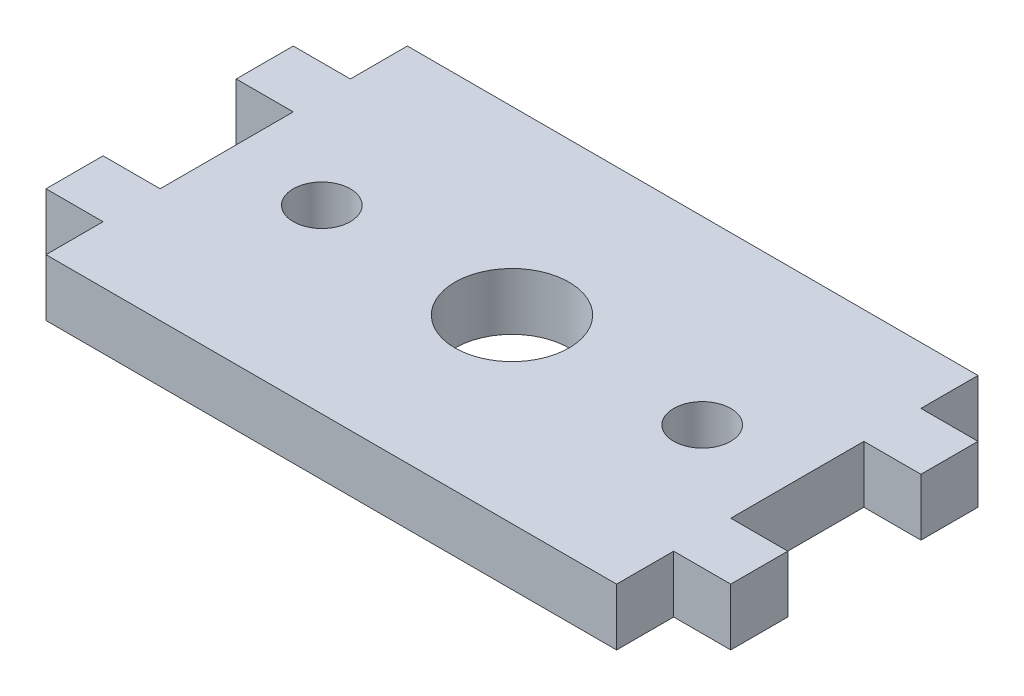
ISO-10303-21;
HEADER;
FILE_DESCRIPTION(('STEP AP214'),'2;1');
FILE_NAME('part.step','',(''),(''),'','','');
FILE_SCHEMA(('AUTOMOTIVE_DESIGN { 1 0 10303 214 1 1 1 1 }'));
ENDSEC;
DATA;
#1=APPLICATION_CONTEXT('core data for automotive mechanical design processes');
#2=APPLICATION_PROTOCOL_DEFINITION('international standard','automotive_design',2000,#1);
#3=PRODUCT_CONTEXT('',#1,'mechanical');
#4=PRODUCT('Part','Part','',(#3));
#5=PRODUCT_RELATED_PRODUCT_CATEGORY('part','',(#4));
#6=PRODUCT_DEFINITION_FORMATION('','',#4);
#7=PRODUCT_DEFINITION_CONTEXT('part definition',#1,'design');
#8=PRODUCT_DEFINITION('design','',#6,#7);
#9=PRODUCT_DEFINITION_SHAPE('','',#8);
#10=(LENGTH_UNIT() NAMED_UNIT(*) SI_UNIT(.MILLI.,.METRE.));
#11=(NAMED_UNIT(*) PLANE_ANGLE_UNIT() SI_UNIT($,.RADIAN.));
#12=(NAMED_UNIT(*) SI_UNIT($,.STERADIAN.) SOLID_ANGLE_UNIT());
#13=UNCERTAINTY_MEASURE_WITH_UNIT(LENGTH_MEASURE(1.E-05),#10,'distance_accuracy_value','');
#14=(GEOMETRIC_REPRESENTATION_CONTEXT(3) GLOBAL_UNCERTAINTY_ASSIGNED_CONTEXT((#13)) GLOBAL_UNIT_ASSIGNED_CONTEXT((#10,
#11,#12)) REPRESENTATION_CONTEXT('',''));
#15=CARTESIAN_POINT('',(0.,0.,0.));
#16=DIRECTION('',(0.,0.,1.));
#17=DIRECTION('',(1.,0.,0.));
#18=AXIS2_PLACEMENT_3D('',#15,#16,#17);
#19=CARTESIAN_POINT('',(0.,3.,0.));
#20=DIRECTION('',(0.,-1.,0.));
#21=DIRECTION('',(0.,0.,-1.));
#22=AXIS2_PLACEMENT_3D('',#19,#20,#21);
#23=PLANE('',#22);
#24=CARTESIAN_POINT('',(-34.8674121918661,3.,-3.5));
#25=DIRECTION('',(0.,1.,0.));
#26=DIRECTION('',(0.,0.,1.));
#27=AXIS2_PLACEMENT_3D('',#24,#25,#26);
#28=CIRCLE('',#27,1.5);
#29=CARTESIAN_POINT('',(-34.8674121918661,3.,-1.99999999999999));
#30=VERTEX_POINT('',#29);
#31=EDGE_CURVE('E391',#30,#30,#28,.T.);
#32=ORIENTED_EDGE('',*,*,#31,.F.);
#33=EDGE_LOOP('',(#32));
#34=FACE_BOUND('',#33,.T.);
#35=DIRECTION('',(1.,0.,0.));
#36=VECTOR('',#35,1.);
#37=CARTESIAN_POINT('',(-39.8674121918661,3.,-7.));
#38=LINE('',#37,#36);
#39=CARTESIAN_POINT('',(-42.8674121918661,3.,-7.));
#40=VERTEX_POINT('',#39);
#41=CARTESIAN_POINT('',(-39.8674121918661,3.,-7.));
#42=VERTEX_POINT('',#41);
#43=EDGE_CURVE('E241',#40,#42,#38,.T.);
#44=ORIENTED_EDGE('',*,*,#43,.T.);
#45=DIRECTION('',(0.,0.,1.));
#46=VECTOR('',#45,1.);
#47=CARTESIAN_POINT('',(-39.8674121918661,3.,0.));
#48=LINE('',#47,#46);
#49=CARTESIAN_POINT('',(-39.8674121918661,3.,0.));
#50=VERTEX_POINT('',#49);
#51=EDGE_CURVE('E129',#42,#50,#48,.T.);
#52=ORIENTED_EDGE('',*,*,#51,.T.);
#53=DIRECTION('',(-1.,0.,0.));
#54=VECTOR('',#53,1.);
#55=CARTESIAN_POINT('',(-42.8674121918661,3.,0.));
#56=LINE('',#55,#54);
#57=CARTESIAN_POINT('',(-42.8674121918661,3.,0.));
#58=VERTEX_POINT('',#57);
#59=EDGE_CURVE('E292',#50,#58,#56,.T.);
#60=ORIENTED_EDGE('',*,*,#59,.T.);
#61=DIRECTION('',(0.,0.,1.));
#62=VECTOR('',#61,1.);
#63=CARTESIAN_POINT('',(-42.8674121918661,3.,3.));
#64=LINE('',#63,#62);
#65=CARTESIAN_POINT('',(-42.8674121918661,3.,3.));
#66=VERTEX_POINT('',#65);
#67=EDGE_CURVE('E311',#58,#66,#64,.T.);
#68=ORIENTED_EDGE('',*,*,#67,.T.);
#69=DIRECTION('',(1.,0.,0.));
#70=VECTOR('',#69,1.);
#71=CARTESIAN_POINT('',(-39.8674121918661,3.,3.));
#72=LINE('',#71,#70);
#73=CARTESIAN_POINT('',(-39.8674121918661,3.,3.));
#74=VERTEX_POINT('',#73);
#75=EDGE_CURVE('E308',#66,#74,#72,.T.);
#76=ORIENTED_EDGE('',*,*,#75,.T.);
#77=DIRECTION('',(0.,0.,1.));
#78=VECTOR('',#77,1.);
#79=CARTESIAN_POINT('',(-39.8674121918661,3.,5.99999999999999));
#80=LINE('',#79,#78);
#81=CARTESIAN_POINT('',(-39.8674121918661,3.,5.99999999999999));
#82=VERTEX_POINT('',#81);
#83=EDGE_CURVE('E310',#74,#82,#80,.T.);
#84=ORIENTED_EDGE('',*,*,#83,.T.);
#85=DIRECTION('',(1.,0.,0.));
#86=VECTOR('',#85,1.);
#87=CARTESIAN_POINT('',(-9.86741219186607,3.,5.99999999999999));
#88=LINE('',#87,#86);
#89=CARTESIAN_POINT('',(-9.86741219186607,3.,5.99999999999999));
#90=VERTEX_POINT('',#89);
#91=EDGE_CURVE('E313',#82,#90,#88,.T.);
#92=ORIENTED_EDGE('',*,*,#91,.T.);
#93=DIRECTION('',(0.,0.,-1.));
#94=VECTOR('',#93,1.);
#95=CARTESIAN_POINT('',(-9.86741219186607,3.,3.));
#96=LINE('',#95,#94);
#97=CARTESIAN_POINT('',(-9.86741219186607,3.,3.));
#98=VERTEX_POINT('',#97);
#99=EDGE_CURVE('E319',#90,#98,#96,.T.);
#100=ORIENTED_EDGE('',*,*,#99,.T.);
#101=DIRECTION('',(1.,0.,0.));
#102=VECTOR('',#101,1.);
#103=CARTESIAN_POINT('',(-6.86741219186606,3.,3.));
#104=LINE('',#103,#102);
#105=CARTESIAN_POINT('',(-6.86741219186606,3.,3.));
#106=VERTEX_POINT('',#105);
#107=EDGE_CURVE('E321',#98,#106,#104,.T.);
#108=ORIENTED_EDGE('',*,*,#107,.T.);
#109=DIRECTION('',(0.,0.,-1.));
#110=VECTOR('',#109,1.);
#111=CARTESIAN_POINT('',(-6.86741219186606,3.,0.));
#112=LINE('',#111,#110);
#113=CARTESIAN_POINT('',(-6.86741219186606,3.,0.));
#114=VERTEX_POINT('',#113);
#115=EDGE_CURVE('E323',#106,#114,#112,.T.);
#116=ORIENTED_EDGE('',*,*,#115,.T.);
#117=DIRECTION('',(-1.,0.,0.));
#118=VECTOR('',#117,1.);
#119=CARTESIAN_POINT('',(-9.86741219186607,3.,0.));
#120=LINE('',#119,#118);
#121=CARTESIAN_POINT('',(-9.86741219186607,3.,0.));
#122=VERTEX_POINT('',#121);
#123=EDGE_CURVE('E325',#114,#122,#120,.T.);
#124=ORIENTED_EDGE('',*,*,#123,.T.);
#125=DIRECTION('',(0.,0.,-1.));
#126=VECTOR('',#125,1.);
#127=CARTESIAN_POINT('',(-9.86741219186607,3.,-7.));
#128=LINE('',#127,#126);
#129=CARTESIAN_POINT('',(-9.86741219186607,3.,-7.));
#130=VERTEX_POINT('',#129);
#131=EDGE_CURVE('E327',#122,#130,#128,.T.);
#132=ORIENTED_EDGE('',*,*,#131,.T.);
#133=DIRECTION('',(1.,0.,0.));
#134=VECTOR('',#133,1.);
#135=CARTESIAN_POINT('',(-6.86741219186607,3.,-7.));
#136=LINE('',#135,#134);
#137=CARTESIAN_POINT('',(-6.86741219186607,3.,-7.));
#138=VERTEX_POINT('',#137);
#139=EDGE_CURVE('E329',#130,#138,#136,.T.);
#140=ORIENTED_EDGE('',*,*,#139,.T.);
#141=DIRECTION('',(0.,0.,-1.));
#142=VECTOR('',#141,1.);
#143=CARTESIAN_POINT('',(-6.86741219186607,3.,-9.99999999999999));
#144=LINE('',#143,#142);
#145=CARTESIAN_POINT('',(-6.86741219186607,3.,-9.99999999999999));
#146=VERTEX_POINT('',#145);
#147=EDGE_CURVE('E331',#138,#146,#144,.T.);
#148=ORIENTED_EDGE('',*,*,#147,.T.);
#149=DIRECTION('',(-1.,0.,0.));
#150=VECTOR('',#149,1.);
#151=CARTESIAN_POINT('',(-9.86741219186607,3.,-9.99999999999999));
#152=LINE('',#151,#150);
#153=CARTESIAN_POINT('',(-9.86741219186607,3.,-9.99999999999999));
#154=VERTEX_POINT('',#153);
#155=EDGE_CURVE('E333',#146,#154,#152,.T.);
#156=ORIENTED_EDGE('',*,*,#155,.T.);
#157=DIRECTION('',(0.,0.,-1.));
#158=VECTOR('',#157,1.);
#159=CARTESIAN_POINT('',(-9.86741219186607,3.,-13.));
#160=LINE('',#159,#158);
#161=CARTESIAN_POINT('',(-9.86741219186607,3.,-13.));
#162=VERTEX_POINT('',#161);
#163=EDGE_CURVE('E335',#154,#162,#160,.T.);
#164=ORIENTED_EDGE('',*,*,#163,.T.);
#165=DIRECTION('',(-1.,0.,0.));
#166=VECTOR('',#165,1.);
#167=CARTESIAN_POINT('',(-39.8674121918661,3.,-13.));
#168=LINE('',#167,#166);
#169=CARTESIAN_POINT('',(-39.8674121918661,3.,-13.));
#170=VERTEX_POINT('',#169);
#171=EDGE_CURVE('E184',#162,#170,#168,.T.);
#172=ORIENTED_EDGE('',*,*,#171,.T.);
#173=DIRECTION('',(0.,0.,1.));
#174=VECTOR('',#173,1.);
#175=CARTESIAN_POINT('',(-39.8674121918661,3.,-9.99999999999999));
#176=LINE('',#175,#174);
#177=CARTESIAN_POINT('',(-39.8674121918661,3.,-9.99999999999999));
#178=VERTEX_POINT('',#177);
#179=EDGE_CURVE('E178',#170,#178,#176,.T.);
#180=ORIENTED_EDGE('',*,*,#179,.T.);
#181=DIRECTION('',(-1.,0.,0.));
#182=VECTOR('',#181,1.);
#183=CARTESIAN_POINT('',(-42.8674121918661,3.,-9.99999999999999));
#184=LINE('',#183,#182);
#185=CARTESIAN_POINT('',(-42.8674121918661,3.,-9.99999999999999));
#186=VERTEX_POINT('',#185);
#187=EDGE_CURVE('E182',#178,#186,#184,.T.);
#188=ORIENTED_EDGE('',*,*,#187,.T.);
#189=DIRECTION('',(0.,0.,1.));
#190=VECTOR('',#189,1.);
#191=CARTESIAN_POINT('',(-42.8674121918661,3.,-7.));
#192=LINE('',#191,#190);
#193=EDGE_CURVE('E50',#186,#40,#192,.T.);
#194=ORIENTED_EDGE('',*,*,#193,.T.);
#195=EDGE_LOOP('',(#44,#52,#60,#68,#76,#84,#92,#100,#108,#116,#124,#132,#140,#148,#156,#164,
#172,#180,#188,#194));
#196=FACE_BOUND('',#195,.T.);
#197=CARTESIAN_POINT('',(-24.8674121918661,3.,-3.5));
#198=DIRECTION('',(0.,1.,0.));
#199=DIRECTION('',(0.,0.,1.));
#200=AXIS2_PLACEMENT_3D('',#197,#198,#199);
#201=CIRCLE('',#200,3.);
#202=CARTESIAN_POINT('',(-24.8674121918661,3.,-0.499999999999999));
#203=VERTEX_POINT('',#202);
#204=EDGE_CURVE('E206',#203,#203,#201,.T.);
#205=ORIENTED_EDGE('',*,*,#204,.F.);
#206=EDGE_LOOP('',(#205));
#207=FACE_BOUND('',#206,.T.);
#208=CARTESIAN_POINT('',(-14.8674121918661,3.,-3.5));
#209=DIRECTION('',(0.,1.,0.));
#210=DIRECTION('',(0.,0.,-1.));
#211=AXIS2_PLACEMENT_3D('',#208,#209,#210);
#212=CIRCLE('',#211,1.5);
#213=CARTESIAN_POINT('',(-14.8674121918661,3.,-5.00000000000001));
#214=VERTEX_POINT('',#213);
#215=EDGE_CURVE('E382',#214,#214,#212,.T.);
#216=ORIENTED_EDGE('',*,*,#215,.F.);
#217=EDGE_LOOP('',(#216));
#218=FACE_BOUND('',#217,.T.);
#219=ADVANCED_FACE('F33',(#34,#196,#207,#218),#23,.F.);
#220=CARTESIAN_POINT('',(0.,0.,0.));
#221=DIRECTION('',(0.,-1.,0.));
#222=DIRECTION('',(0.,0.,-1.));
#223=AXIS2_PLACEMENT_3D('',#220,#221,#222);
#224=PLANE('',#223);
#225=CARTESIAN_POINT('',(-34.8674121918661,0.,-3.5));
#226=DIRECTION('',(0.,1.,0.));
#227=DIRECTION('',(0.,0.,1.));
#228=AXIS2_PLACEMENT_3D('',#225,#226,#227);
#229=CIRCLE('',#228,1.5);
#230=CARTESIAN_POINT('',(-34.8674121918661,0.,-1.99999999999999));
#231=VERTEX_POINT('',#230);
#232=EDGE_CURVE('E388',#231,#231,#229,.T.);
#233=ORIENTED_EDGE('',*,*,#232,.T.);
#234=EDGE_LOOP('',(#233));
#235=FACE_BOUND('',#234,.T.);
#236=DIRECTION('',(1.,0.,0.));
#237=VECTOR('',#236,1.);
#238=CARTESIAN_POINT('',(-39.8674121918661,0.,-7.));
#239=LINE('',#238,#237);
#240=CARTESIAN_POINT('',(-42.8674121918661,0.,-7.));
#241=VERTEX_POINT('',#240);
#242=CARTESIAN_POINT('',(-39.8674121918661,0.,-7.));
#243=VERTEX_POINT('',#242);
#244=EDGE_CURVE('E202',#241,#243,#239,.T.);
#245=ORIENTED_EDGE('',*,*,#244,.F.);
#246=DIRECTION('',(0.,0.,1.));
#247=VECTOR('',#246,1.);
#248=CARTESIAN_POINT('',(-42.8674121918661,0.,-7.));
#249=LINE('',#248,#247);
#250=CARTESIAN_POINT('',(-42.8674121918661,0.,-9.99999999999999));
#251=VERTEX_POINT('',#250);
#252=EDGE_CURVE('E121',#251,#241,#249,.T.);
#253=ORIENTED_EDGE('',*,*,#252,.F.);
#254=DIRECTION('',(-1.,0.,0.));
#255=VECTOR('',#254,1.);
#256=CARTESIAN_POINT('',(-42.8674121918661,0.,-9.99999999999999));
#257=LINE('',#256,#255);
#258=CARTESIAN_POINT('',(-39.8674121918661,0.,-9.99999999999999));
#259=VERTEX_POINT('',#258);
#260=EDGE_CURVE('E115',#259,#251,#257,.T.);
#261=ORIENTED_EDGE('',*,*,#260,.F.);
#262=DIRECTION('',(0.,0.,1.));
#263=VECTOR('',#262,1.);
#264=CARTESIAN_POINT('',(-39.8674121918661,0.,-9.99999999999999));
#265=LINE('',#264,#263);
#266=CARTESIAN_POINT('',(-39.8674121918661,0.,-13.));
#267=VERTEX_POINT('',#266);
#268=EDGE_CURVE('E192',#267,#259,#265,.T.);
#269=ORIENTED_EDGE('',*,*,#268,.F.);
#270=DIRECTION('',(-1.,0.,0.));
#271=VECTOR('',#270,1.);
#272=CARTESIAN_POINT('',(-39.8674121918661,0.,-13.));
#273=LINE('',#272,#271);
#274=CARTESIAN_POINT('',(-9.86741219186607,0.,-13.));
#275=VERTEX_POINT('',#274);
#276=EDGE_CURVE('E236',#275,#267,#273,.T.);
#277=ORIENTED_EDGE('',*,*,#276,.F.);
#278=DIRECTION('',(0.,0.,-1.));
#279=VECTOR('',#278,1.);
#280=CARTESIAN_POINT('',(-9.86741219186607,0.,-13.));
#281=LINE('',#280,#279);
#282=CARTESIAN_POINT('',(-9.86741219186607,0.,-9.99999999999999));
#283=VERTEX_POINT('',#282);
#284=EDGE_CURVE('E234',#283,#275,#281,.T.);
#285=ORIENTED_EDGE('',*,*,#284,.F.);
#286=DIRECTION('',(-1.,0.,0.));
#287=VECTOR('',#286,1.);
#288=CARTESIAN_POINT('',(-9.86741219186607,0.,-9.99999999999999));
#289=LINE('',#288,#287);
#290=CARTESIAN_POINT('',(-6.86741219186607,0.,-9.99999999999999));
#291=VERTEX_POINT('',#290);
#292=EDGE_CURVE('E232',#291,#283,#289,.T.);
#293=ORIENTED_EDGE('',*,*,#292,.F.);
#294=DIRECTION('',(0.,0.,-1.));
#295=VECTOR('',#294,1.);
#296=CARTESIAN_POINT('',(-6.86741219186607,0.,-9.99999999999999));
#297=LINE('',#296,#295);
#298=CARTESIAN_POINT('',(-6.86741219186607,0.,-7.));
#299=VERTEX_POINT('',#298);
#300=EDGE_CURVE('E230',#299,#291,#297,.T.);
#301=ORIENTED_EDGE('',*,*,#300,.F.);
#302=DIRECTION('',(1.,0.,0.));
#303=VECTOR('',#302,1.);
#304=CARTESIAN_POINT('',(-6.86741219186607,0.,-7.));
#305=LINE('',#304,#303);
#306=CARTESIAN_POINT('',(-9.86741219186607,0.,-7.));
#307=VERTEX_POINT('',#306);
#308=EDGE_CURVE('E228',#307,#299,#305,.T.);
#309=ORIENTED_EDGE('',*,*,#308,.F.);
#310=DIRECTION('',(0.,0.,-1.));
#311=VECTOR('',#310,1.);
#312=CARTESIAN_POINT('',(-9.86741219186607,0.,-7.));
#313=LINE('',#312,#311);
#314=CARTESIAN_POINT('',(-9.86741219186607,0.,0.));
#315=VERTEX_POINT('',#314);
#316=EDGE_CURVE('E226',#315,#307,#313,.T.);
#317=ORIENTED_EDGE('',*,*,#316,.F.);
#318=DIRECTION('',(-1.,0.,0.));
#319=VECTOR('',#318,1.);
#320=CARTESIAN_POINT('',(-9.86741219186607,0.,0.));
#321=LINE('',#320,#319);
#322=CARTESIAN_POINT('',(-6.86741219186606,0.,0.));
#323=VERTEX_POINT('',#322);
#324=EDGE_CURVE('E224',#323,#315,#321,.T.);
#325=ORIENTED_EDGE('',*,*,#324,.F.);
#326=DIRECTION('',(0.,0.,-1.));
#327=VECTOR('',#326,1.);
#328=CARTESIAN_POINT('',(-6.86741219186606,0.,0.));
#329=LINE('',#328,#327);
#330=CARTESIAN_POINT('',(-6.86741219186606,0.,3.));
#331=VERTEX_POINT('',#330);
#332=EDGE_CURVE('E222',#331,#323,#329,.T.);
#333=ORIENTED_EDGE('',*,*,#332,.F.);
#334=DIRECTION('',(1.,0.,0.));
#335=VECTOR('',#334,1.);
#336=CARTESIAN_POINT('',(-6.86741219186606,0.,3.));
#337=LINE('',#336,#335);
#338=CARTESIAN_POINT('',(-9.86741219186607,0.,3.));
#339=VERTEX_POINT('',#338);
#340=EDGE_CURVE('E220',#339,#331,#337,.T.);
#341=ORIENTED_EDGE('',*,*,#340,.F.);
#342=DIRECTION('',(0.,0.,-1.));
#343=VECTOR('',#342,1.);
#344=CARTESIAN_POINT('',(-9.86741219186607,0.,3.));
#345=LINE('',#344,#343);
#346=CARTESIAN_POINT('',(-9.86741219186607,0.,5.99999999999999));
#347=VERTEX_POINT('',#346);
#348=EDGE_CURVE('E218',#347,#339,#345,.T.);
#349=ORIENTED_EDGE('',*,*,#348,.F.);
#350=DIRECTION('',(1.,0.,0.));
#351=VECTOR('',#350,1.);
#352=CARTESIAN_POINT('',(-9.86741219186607,0.,5.99999999999999));
#353=LINE('',#352,#351);
#354=CARTESIAN_POINT('',(-39.8674121918661,0.,5.99999999999999));
#355=VERTEX_POINT('',#354);
#356=EDGE_CURVE('E216',#355,#347,#353,.T.);
#357=ORIENTED_EDGE('',*,*,#356,.F.);
#358=DIRECTION('',(0.,0.,1.));
#359=VECTOR('',#358,1.);
#360=CARTESIAN_POINT('',(-39.8674121918661,0.,5.99999999999999));
#361=LINE('',#360,#359);
#362=CARTESIAN_POINT('',(-39.8674121918661,0.,3.));
#363=VERTEX_POINT('',#362);
#364=EDGE_CURVE('E214',#363,#355,#361,.T.);
#365=ORIENTED_EDGE('',*,*,#364,.F.);
#366=DIRECTION('',(1.,0.,0.));
#367=VECTOR('',#366,1.);
#368=CARTESIAN_POINT('',(-39.8674121918661,0.,3.));
#369=LINE('',#368,#367);
#370=CARTESIAN_POINT('',(-42.8674121918661,0.,3.));
#371=VERTEX_POINT('',#370);
#372=EDGE_CURVE('E212',#371,#363,#369,.T.);
#373=ORIENTED_EDGE('',*,*,#372,.F.);
#374=DIRECTION('',(0.,0.,1.));
#375=VECTOR('',#374,1.);
#376=CARTESIAN_POINT('',(-42.8674121918661,0.,3.));
#377=LINE('',#376,#375);
#378=CARTESIAN_POINT('',(-42.8674121918661,0.,0.));
#379=VERTEX_POINT('',#378);
#380=EDGE_CURVE('E210',#379,#371,#377,.T.);
#381=ORIENTED_EDGE('',*,*,#380,.F.);
#382=DIRECTION('',(-1.,0.,0.));
#383=VECTOR('',#382,1.);
#384=CARTESIAN_POINT('',(-42.8674121918661,0.,0.));
#385=LINE('',#384,#383);
#386=CARTESIAN_POINT('',(-39.8674121918661,0.,0.));
#387=VERTEX_POINT('',#386);
#388=EDGE_CURVE('E208',#387,#379,#385,.T.);
#389=ORIENTED_EDGE('',*,*,#388,.F.);
#390=DIRECTION('',(0.,0.,1.));
#391=VECTOR('',#390,1.);
#392=CARTESIAN_POINT('',(-39.8674121918661,0.,0.));
#393=LINE('',#392,#391);
#394=EDGE_CURVE('E205',#243,#387,#393,.T.);
#395=ORIENTED_EDGE('',*,*,#394,.F.);
#396=EDGE_LOOP('',(#245,#253,#261,#269,#277,#285,#293,#301,#309,#317,#325,#333,#341,#349,#357,
#365,#373,#381,#389,#395));
#397=FACE_BOUND('',#396,.T.);
#398=CARTESIAN_POINT('',(-24.8674121918661,0.,-3.5));
#399=DIRECTION('',(0.,1.,0.));
#400=DIRECTION('',(0.,0.,1.));
#401=AXIS2_PLACEMENT_3D('',#398,#399,#400);
#402=CIRCLE('',#401,3.);
#403=CARTESIAN_POINT('',(-24.8674121918661,0.,-0.499999999999999));
#404=VERTEX_POINT('',#403);
#405=EDGE_CURVE('E394',#404,#404,#402,.T.);
#406=ORIENTED_EDGE('',*,*,#405,.T.);
#407=EDGE_LOOP('',(#406));
#408=FACE_BOUND('',#407,.T.);
#409=CARTESIAN_POINT('',(-14.8674121918661,0.,-3.5));
#410=DIRECTION('',(0.,1.,0.));
#411=DIRECTION('',(0.,0.,-1.));
#412=AXIS2_PLACEMENT_3D('',#409,#410,#411);
#413=CIRCLE('',#412,1.5);
#414=CARTESIAN_POINT('',(-14.8674121918661,0.,-5.00000000000001));
#415=VERTEX_POINT('',#414);
#416=EDGE_CURVE('E385',#415,#415,#413,.T.);
#417=ORIENTED_EDGE('',*,*,#416,.T.);
#418=EDGE_LOOP('',(#417));
#419=FACE_BOUND('',#418,.T.);
#420=ADVANCED_FACE('F296',(#235,#397,#408,#419),#224,.T.);
#421=CARTESIAN_POINT('',(-39.8674121918661,3.,-7.));
#422=DIRECTION('',(0.,0.,-1.));
#423=DIRECTION('',(-1.,0.,0.));
#424=AXIS2_PLACEMENT_3D('',#421,#422,#423);
#425=PLANE('',#424);
#426=ORIENTED_EDGE('',*,*,#244,.T.);
#427=DIRECTION('',(0.,-1.,0.));
#428=VECTOR('',#427,1.);
#429=CARTESIAN_POINT('',(-39.8674121918661,3.,-7.));
#430=LINE('',#429,#428);
#431=EDGE_CURVE('E11',#42,#243,#430,.T.);
#432=ORIENTED_EDGE('',*,*,#431,.F.);
#433=ORIENTED_EDGE('',*,*,#43,.F.);
#434=DIRECTION('',(0.,-1.,0.));
#435=VECTOR('',#434,1.);
#436=CARTESIAN_POINT('',(-42.8674121918661,3.,-7.));
#437=LINE('',#436,#435);
#438=EDGE_CURVE('E198',#40,#241,#437,.T.);
#439=ORIENTED_EDGE('',*,*,#438,.T.);
#440=EDGE_LOOP('',(#426,#432,#433,#439));
#441=FACE_BOUND('',#440,.T.);
#442=ADVANCED_FACE('F35',(#441),#425,.F.);
#443=CARTESIAN_POINT('',(-39.8674121918661,3.,0.));
#444=DIRECTION('',(1.,0.,0.));
#445=DIRECTION('',(0.,0.,-1.));
#446=AXIS2_PLACEMENT_3D('',#443,#444,#445);
#447=PLANE('',#446);
#448=ORIENTED_EDGE('',*,*,#394,.T.);
#449=DIRECTION('',(0.,-1.,0.));
#450=VECTOR('',#449,1.);
#451=CARTESIAN_POINT('',(-39.8674121918661,3.,0.));
#452=LINE('',#451,#450);
#453=EDGE_CURVE('E42',#50,#387,#452,.T.);
#454=ORIENTED_EDGE('',*,*,#453,.F.);
#455=ORIENTED_EDGE('',*,*,#51,.F.);
#456=ORIENTED_EDGE('',*,*,#431,.T.);
#457=EDGE_LOOP('',(#448,#454,#455,#456));
#458=FACE_BOUND('',#457,.T.);
#459=ADVANCED_FACE('F575',(#458),#447,.F.);
#460=CARTESIAN_POINT('',(-42.8674121918661,3.,0.));
#461=DIRECTION('',(0.,0.,1.));
#462=DIRECTION('',(1.,0.,0.));
#463=AXIS2_PLACEMENT_3D('',#460,#461,#462);
#464=PLANE('',#463);
#465=ORIENTED_EDGE('',*,*,#388,.T.);
#466=DIRECTION('',(0.,-1.,0.));
#467=VECTOR('',#466,1.);
#468=CARTESIAN_POINT('',(-42.8674121918661,3.,0.));
#469=LINE('',#468,#467);
#470=EDGE_CURVE('E284',#58,#379,#469,.T.);
#471=ORIENTED_EDGE('',*,*,#470,.F.);
#472=ORIENTED_EDGE('',*,*,#59,.F.);
#473=ORIENTED_EDGE('',*,*,#453,.T.);
#474=EDGE_LOOP('',(#465,#471,#472,#473));
#475=FACE_BOUND('',#474,.T.);
#476=ADVANCED_FACE('F290',(#475),#464,.F.);
#477=CARTESIAN_POINT('',(-42.8674121918661,3.,3.));
#478=DIRECTION('',(1.,0.,0.));
#479=DIRECTION('',(0.,0.,-1.));
#480=AXIS2_PLACEMENT_3D('',#477,#478,#479);
#481=PLANE('',#480);
#482=ORIENTED_EDGE('',*,*,#380,.T.);
#483=DIRECTION('',(0.,-1.,0.));
#484=VECTOR('',#483,1.);
#485=CARTESIAN_POINT('',(-42.8674121918661,3.,3.));
#486=LINE('',#485,#484);
#487=EDGE_CURVE('E281',#66,#371,#486,.T.);
#488=ORIENTED_EDGE('',*,*,#487,.F.);
#489=ORIENTED_EDGE('',*,*,#67,.F.);
#490=ORIENTED_EDGE('',*,*,#470,.T.);
#491=EDGE_LOOP('',(#482,#488,#489,#490));
#492=FACE_BOUND('',#491,.T.);
#493=ADVANCED_FACE('F302',(#492),#481,.F.);
#494=CARTESIAN_POINT('',(-39.8674121918661,3.,3.));
#495=DIRECTION('',(0.,0.,-1.));
#496=DIRECTION('',(-1.,0.,0.));
#497=AXIS2_PLACEMENT_3D('',#494,#495,#496);
#498=PLANE('',#497);
#499=ORIENTED_EDGE('',*,*,#372,.T.);
#500=DIRECTION('',(0.,-1.,0.));
#501=VECTOR('',#500,1.);
#502=CARTESIAN_POINT('',(-39.8674121918661,3.,3.));
#503=LINE('',#502,#501);
#504=EDGE_CURVE('E278',#74,#363,#503,.T.);
#505=ORIENTED_EDGE('',*,*,#504,.F.);
#506=ORIENTED_EDGE('',*,*,#75,.F.);
#507=ORIENTED_EDGE('',*,*,#487,.T.);
#508=EDGE_LOOP('',(#499,#505,#506,#507));
#509=FACE_BOUND('',#508,.T.);
#510=ADVANCED_FACE('F306',(#509),#498,.F.);
#511=CARTESIAN_POINT('',(-39.8674121918661,3.,5.99999999999999));
#512=DIRECTION('',(1.,0.,0.));
#513=DIRECTION('',(0.,0.,-1.));
#514=AXIS2_PLACEMENT_3D('',#511,#512,#513);
#515=PLANE('',#514);
#516=ORIENTED_EDGE('',*,*,#364,.T.);
#517=DIRECTION('',(0.,-1.,0.));
#518=VECTOR('',#517,1.);
#519=CARTESIAN_POINT('',(-39.8674121918661,3.,5.99999999999999));
#520=LINE('',#519,#518);
#521=EDGE_CURVE('E275',#82,#355,#520,.T.);
#522=ORIENTED_EDGE('',*,*,#521,.F.);
#523=ORIENTED_EDGE('',*,*,#83,.F.);
#524=ORIENTED_EDGE('',*,*,#504,.T.);
#525=EDGE_LOOP('',(#516,#522,#523,#524));
#526=FACE_BOUND('',#525,.T.);
#527=ADVANCED_FACE('F540',(#526),#515,.F.);
#528=CARTESIAN_POINT('',(-9.86741219186607,3.,5.99999999999999));
#529=DIRECTION('',(0.,0.,-1.));
#530=DIRECTION('',(-1.,0.,0.));
#531=AXIS2_PLACEMENT_3D('',#528,#529,#530);
#532=PLANE('',#531);
#533=ORIENTED_EDGE('',*,*,#356,.T.);
#534=DIRECTION('',(0.,-1.,0.));
#535=VECTOR('',#534,1.);
#536=CARTESIAN_POINT('',(-9.86741219186607,3.,5.99999999999999));
#537=LINE('',#536,#535);
#538=EDGE_CURVE('E272',#90,#347,#537,.T.);
#539=ORIENTED_EDGE('',*,*,#538,.F.);
#540=ORIENTED_EDGE('',*,*,#91,.F.);
#541=ORIENTED_EDGE('',*,*,#521,.T.);
#542=EDGE_LOOP('',(#533,#539,#540,#541));
#543=FACE_BOUND('',#542,.T.);
#544=ADVANCED_FACE('F530',(#543),#532,.F.);
#545=CARTESIAN_POINT('',(-9.86741219186607,3.,3.));
#546=DIRECTION('',(-1.,0.,0.));
#547=DIRECTION('',(0.,0.,1.));
#548=AXIS2_PLACEMENT_3D('',#545,#546,#547);
#549=PLANE('',#548);
#550=ORIENTED_EDGE('',*,*,#348,.T.);
#551=DIRECTION('',(0.,-1.,0.));
#552=VECTOR('',#551,1.);
#553=CARTESIAN_POINT('',(-9.86741219186607,3.,3.));
#554=LINE('',#553,#552);
#555=EDGE_CURVE('E269',#98,#339,#554,.T.);
#556=ORIENTED_EDGE('',*,*,#555,.F.);
#557=ORIENTED_EDGE('',*,*,#99,.F.);
#558=ORIENTED_EDGE('',*,*,#538,.T.);
#559=EDGE_LOOP('',(#550,#556,#557,#558));
#560=FACE_BOUND('',#559,.T.);
#561=ADVANCED_FACE('F520',(#560),#549,.F.);
#562=CARTESIAN_POINT('',(-6.86741219186606,3.,3.));
#563=DIRECTION('',(0.,0.,-1.));
#564=DIRECTION('',(-1.,0.,0.));
#565=AXIS2_PLACEMENT_3D('',#562,#563,#564);
#566=PLANE('',#565);
#567=ORIENTED_EDGE('',*,*,#340,.T.);
#568=DIRECTION('',(0.,-1.,0.));
#569=VECTOR('',#568,1.);
#570=CARTESIAN_POINT('',(-6.86741219186606,3.,3.));
#571=LINE('',#570,#569);
#572=EDGE_CURVE('E266',#106,#331,#571,.T.);
#573=ORIENTED_EDGE('',*,*,#572,.F.);
#574=ORIENTED_EDGE('',*,*,#107,.F.);
#575=ORIENTED_EDGE('',*,*,#555,.T.);
#576=EDGE_LOOP('',(#567,#573,#574,#575));
#577=FACE_BOUND('',#576,.T.);
#578=ADVANCED_FACE('F510',(#577),#566,.F.);
#579=CARTESIAN_POINT('',(-6.86741219186606,3.,0.));
#580=DIRECTION('',(-1.,0.,0.));
#581=DIRECTION('',(0.,0.,1.));
#582=AXIS2_PLACEMENT_3D('',#579,#580,#581);
#583=PLANE('',#582);
#584=ORIENTED_EDGE('',*,*,#332,.T.);
#585=DIRECTION('',(0.,-1.,0.));
#586=VECTOR('',#585,1.);
#587=CARTESIAN_POINT('',(-6.86741219186606,3.,0.));
#588=LINE('',#587,#586);
#589=EDGE_CURVE('E263',#114,#323,#588,.T.);
#590=ORIENTED_EDGE('',*,*,#589,.F.);
#591=ORIENTED_EDGE('',*,*,#115,.F.);
#592=ORIENTED_EDGE('',*,*,#572,.T.);
#593=EDGE_LOOP('',(#584,#590,#591,#592));
#594=FACE_BOUND('',#593,.T.);
#595=ADVANCED_FACE('F500',(#594),#583,.F.);
#596=CARTESIAN_POINT('',(-9.86741219186607,3.,0.));
#597=DIRECTION('',(0.,0.,1.));
#598=DIRECTION('',(1.,0.,0.));
#599=AXIS2_PLACEMENT_3D('',#596,#597,#598);
#600=PLANE('',#599);
#601=ORIENTED_EDGE('',*,*,#324,.T.);
#602=DIRECTION('',(0.,-1.,0.));
#603=VECTOR('',#602,1.);
#604=CARTESIAN_POINT('',(-9.86741219186607,3.,0.));
#605=LINE('',#604,#603);
#606=EDGE_CURVE('E260',#122,#315,#605,.T.);
#607=ORIENTED_EDGE('',*,*,#606,.F.);
#608=ORIENTED_EDGE('',*,*,#123,.F.);
#609=ORIENTED_EDGE('',*,*,#589,.T.);
#610=EDGE_LOOP('',(#601,#607,#608,#609));
#611=FACE_BOUND('',#610,.T.);
#612=ADVANCED_FACE('F490',(#611),#600,.F.);
#613=CARTESIAN_POINT('',(-9.86741219186607,3.,-7.));
#614=DIRECTION('',(-1.,0.,0.));
#615=DIRECTION('',(0.,0.,1.));
#616=AXIS2_PLACEMENT_3D('',#613,#614,#615);
#617=PLANE('',#616);
#618=ORIENTED_EDGE('',*,*,#316,.T.);
#619=DIRECTION('',(0.,-1.,0.));
#620=VECTOR('',#619,1.);
#621=CARTESIAN_POINT('',(-9.86741219186607,3.,-7.));
#622=LINE('',#621,#620);
#623=EDGE_CURVE('E257',#130,#307,#622,.T.);
#624=ORIENTED_EDGE('',*,*,#623,.F.);
#625=ORIENTED_EDGE('',*,*,#131,.F.);
#626=ORIENTED_EDGE('',*,*,#606,.T.);
#627=EDGE_LOOP('',(#618,#624,#625,#626));
#628=FACE_BOUND('',#627,.T.);
#629=ADVANCED_FACE('F480',(#628),#617,.F.);
#630=CARTESIAN_POINT('',(-6.86741219186607,3.,-7.));
#631=DIRECTION('',(0.,0.,-1.));
#632=DIRECTION('',(-1.,0.,0.));
#633=AXIS2_PLACEMENT_3D('',#630,#631,#632);
#634=PLANE('',#633);
#635=ORIENTED_EDGE('',*,*,#308,.T.);
#636=DIRECTION('',(0.,-1.,0.));
#637=VECTOR('',#636,1.);
#638=CARTESIAN_POINT('',(-6.86741219186607,3.,-7.));
#639=LINE('',#638,#637);
#640=EDGE_CURVE('E254',#138,#299,#639,.T.);
#641=ORIENTED_EDGE('',*,*,#640,.F.);
#642=ORIENTED_EDGE('',*,*,#139,.F.);
#643=ORIENTED_EDGE('',*,*,#623,.T.);
#644=EDGE_LOOP('',(#635,#641,#642,#643));
#645=FACE_BOUND('',#644,.T.);
#646=ADVANCED_FACE('F470',(#645),#634,.F.);
#647=CARTESIAN_POINT('',(-6.86741219186607,3.,-9.99999999999999));
#648=DIRECTION('',(-1.,0.,0.));
#649=DIRECTION('',(0.,0.,1.));
#650=AXIS2_PLACEMENT_3D('',#647,#648,#649);
#651=PLANE('',#650);
#652=ORIENTED_EDGE('',*,*,#300,.T.);
#653=DIRECTION('',(0.,-1.,0.));
#654=VECTOR('',#653,1.);
#655=CARTESIAN_POINT('',(-6.86741219186607,3.,-9.99999999999999));
#656=LINE('',#655,#654);
#657=EDGE_CURVE('E251',#146,#291,#656,.T.);
#658=ORIENTED_EDGE('',*,*,#657,.F.);
#659=ORIENTED_EDGE('',*,*,#147,.F.);
#660=ORIENTED_EDGE('',*,*,#640,.T.);
#661=EDGE_LOOP('',(#652,#658,#659,#660));
#662=FACE_BOUND('',#661,.T.);
#663=ADVANCED_FACE('F460',(#662),#651,.F.);
#664=CARTESIAN_POINT('',(-9.86741219186607,3.,-9.99999999999999));
#665=DIRECTION('',(0.,0.,1.));
#666=DIRECTION('',(1.,0.,0.));
#667=AXIS2_PLACEMENT_3D('',#664,#665,#666);
#668=PLANE('',#667);
#669=ORIENTED_EDGE('',*,*,#292,.T.);
#670=DIRECTION('',(0.,-1.,0.));
#671=VECTOR('',#670,1.);
#672=CARTESIAN_POINT('',(-9.86741219186607,3.,-9.99999999999999));
#673=LINE('',#672,#671);
#674=EDGE_CURVE('E248',#154,#283,#673,.T.);
#675=ORIENTED_EDGE('',*,*,#674,.F.);
#676=ORIENTED_EDGE('',*,*,#155,.F.);
#677=ORIENTED_EDGE('',*,*,#657,.T.);
#678=EDGE_LOOP('',(#669,#675,#676,#677));
#679=FACE_BOUND('',#678,.T.);
#680=ADVANCED_FACE('F451',(#679),#668,.F.);
#681=CARTESIAN_POINT('',(-9.86741219186607,3.,-13.));
#682=DIRECTION('',(-1.,0.,0.));
#683=DIRECTION('',(0.,0.,1.));
#684=AXIS2_PLACEMENT_3D('',#681,#682,#683);
#685=PLANE('',#684);
#686=ORIENTED_EDGE('',*,*,#284,.T.);
#687=DIRECTION('',(0.,-1.,0.));
#688=VECTOR('',#687,1.);
#689=CARTESIAN_POINT('',(-9.86741219186607,3.,-13.));
#690=LINE('',#689,#688);
#691=EDGE_CURVE('E245',#162,#275,#690,.T.);
#692=ORIENTED_EDGE('',*,*,#691,.F.);
#693=ORIENTED_EDGE('',*,*,#163,.F.);
#694=ORIENTED_EDGE('',*,*,#674,.T.);
#695=EDGE_LOOP('',(#686,#692,#693,#694));
#696=FACE_BOUND('',#695,.T.);
#697=ADVANCED_FACE('F341',(#696),#685,.F.);
#698=CARTESIAN_POINT('',(-39.8674121918661,3.,-13.));
#699=DIRECTION('',(0.,0.,1.));
#700=DIRECTION('',(1.,0.,0.));
#701=AXIS2_PLACEMENT_3D('',#698,#699,#700);
#702=PLANE('',#701);
#703=ORIENTED_EDGE('',*,*,#276,.T.);
#704=DIRECTION('',(0.,-1.,0.));
#705=VECTOR('',#704,1.);
#706=CARTESIAN_POINT('',(-39.8674121918661,3.,-13.));
#707=LINE('',#706,#705);
#708=EDGE_CURVE('E193',#170,#267,#707,.T.);
#709=ORIENTED_EDGE('',*,*,#708,.F.);
#710=ORIENTED_EDGE('',*,*,#171,.F.);
#711=ORIENTED_EDGE('',*,*,#691,.T.);
#712=EDGE_LOOP('',(#703,#709,#710,#711));
#713=FACE_BOUND('',#712,.T.);
#714=ADVANCED_FACE('F345',(#713),#702,.F.);
#715=CARTESIAN_POINT('',(-39.8674121918661,3.,-9.99999999999999));
#716=DIRECTION('',(1.,0.,0.));
#717=DIRECTION('',(0.,0.,-1.));
#718=AXIS2_PLACEMENT_3D('',#715,#716,#717);
#719=PLANE('',#718);
#720=ORIENTED_EDGE('',*,*,#268,.T.);
#721=DIRECTION('',(0.,-1.,0.));
#722=VECTOR('',#721,1.);
#723=CARTESIAN_POINT('',(-39.8674121918661,3.,-9.99999999999999));
#724=LINE('',#723,#722);
#725=EDGE_CURVE('E189',#178,#259,#724,.T.);
#726=ORIENTED_EDGE('',*,*,#725,.F.);
#727=ORIENTED_EDGE('',*,*,#179,.F.);
#728=ORIENTED_EDGE('',*,*,#708,.T.);
#729=EDGE_LOOP('',(#720,#726,#727,#728));
#730=FACE_BOUND('',#729,.T.);
#731=ADVANCED_FACE('F190',(#730),#719,.F.);
#732=CARTESIAN_POINT('',(-42.8674121918661,3.,-9.99999999999999));
#733=DIRECTION('',(0.,0.,1.));
#734=DIRECTION('',(1.,0.,0.));
#735=AXIS2_PLACEMENT_3D('',#732,#733,#734);
#736=PLANE('',#735);
#737=ORIENTED_EDGE('',*,*,#260,.T.);
#738=DIRECTION('',(0.,-1.,0.));
#739=VECTOR('',#738,1.);
#740=CARTESIAN_POINT('',(-42.8674121918661,3.,-9.99999999999999));
#741=LINE('',#740,#739);
#742=EDGE_CURVE('E194',#186,#251,#741,.T.);
#743=ORIENTED_EDGE('',*,*,#742,.F.);
#744=ORIENTED_EDGE('',*,*,#187,.F.);
#745=ORIENTED_EDGE('',*,*,#725,.T.);
#746=EDGE_LOOP('',(#737,#743,#744,#745));
#747=FACE_BOUND('',#746,.T.);
#748=ADVANCED_FACE('F196',(#747),#736,.F.);
#749=CARTESIAN_POINT('',(-42.8674121918661,3.,-7.));
#750=DIRECTION('',(1.,0.,0.));
#751=DIRECTION('',(0.,0.,-1.));
#752=AXIS2_PLACEMENT_3D('',#749,#750,#751);
#753=PLANE('',#752);
#754=ORIENTED_EDGE('',*,*,#252,.T.);
#755=ORIENTED_EDGE('',*,*,#438,.F.);
#756=ORIENTED_EDGE('',*,*,#193,.F.);
#757=ORIENTED_EDGE('',*,*,#742,.T.);
#758=EDGE_LOOP('',(#754,#755,#756,#757));
#759=FACE_BOUND('',#758,.T.);
#760=ADVANCED_FACE('F349',(#759),#753,.F.);
#761=CARTESIAN_POINT('',(-24.8674121918661,3.,-3.5));
#762=DIRECTION('',(0.,-1.,0.));
#763=DIRECTION('',(0.,0.,-1.));
#764=AXIS2_PLACEMENT_3D('',#761,#762,#763);
#765=CYLINDRICAL_SURFACE('',#764,3.);
#766=ORIENTED_EDGE('',*,*,#204,.T.);
#767=EDGE_LOOP('',(#766));
#768=FACE_BOUND('',#767,.T.);
#769=ORIENTED_EDGE('',*,*,#405,.F.);
#770=EDGE_LOOP('',(#769));
#771=FACE_BOUND('',#770,.T.);
#772=ADVANCED_FACE('F351',(#768,#771),#765,.F.);
#773=CARTESIAN_POINT('',(-34.8674121918661,3.,-3.5));
#774=DIRECTION('',(0.,-1.,0.));
#775=DIRECTION('',(0.,0.,-1.));
#776=AXIS2_PLACEMENT_3D('',#773,#774,#775);
#777=CYLINDRICAL_SURFACE('',#776,1.5);
#778=ORIENTED_EDGE('',*,*,#31,.T.);
#779=EDGE_LOOP('',(#778));
#780=FACE_BOUND('',#779,.T.);
#781=ORIENTED_EDGE('',*,*,#232,.F.);
#782=EDGE_LOOP('',(#781));
#783=FACE_BOUND('',#782,.T.);
#784=ADVANCED_FACE('F357',(#780,#783),#777,.F.);
#785=CARTESIAN_POINT('',(-14.8674121918661,3.,-3.5));
#786=DIRECTION('',(0.,-1.,0.));
#787=DIRECTION('',(0.,0.,-1.));
#788=AXIS2_PLACEMENT_3D('',#785,#786,#787);
#789=CYLINDRICAL_SURFACE('',#788,1.5);
#790=ORIENTED_EDGE('',*,*,#215,.T.);
#791=EDGE_LOOP('',(#790));
#792=FACE_BOUND('',#791,.T.);
#793=ORIENTED_EDGE('',*,*,#416,.F.);
#794=EDGE_LOOP('',(#793));
#795=FACE_BOUND('',#794,.T.);
#796=ADVANCED_FACE('F373',(#792,#795),#789,.F.);
#797=CLOSED_SHELL('',(#219,#420,#442,#459,#476,#493,#510,#527,#544,#561,#578,#595,#612,#629,
#646,#663,#680,#697,#714,#731,#748,#760,#772,#784,#796));
#798=MANIFOLD_SOLID_BREP('B2',#797);
#799=ADVANCED_BREP_SHAPE_REPRESENTATION('',(#18,#798),#14);
#800=SHAPE_DEFINITION_REPRESENTATION(#9,#799);
ENDSEC;
END-ISO-10303-21;
